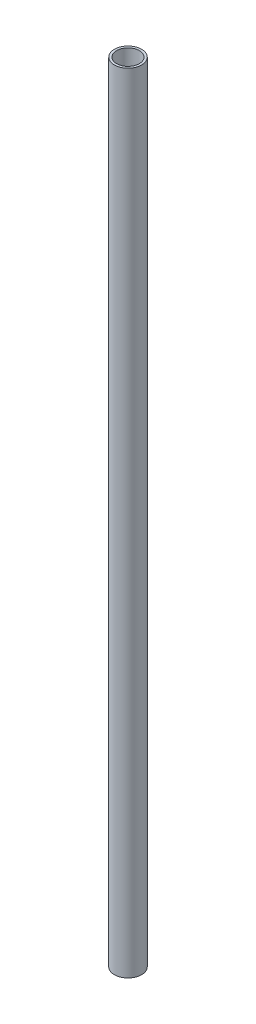
ISO-10303-21;
HEADER;
FILE_DESCRIPTION(('STEP AP214'),'2;1');
FILE_NAME('part.step','',(''),(''),'','','');
FILE_SCHEMA(('AUTOMOTIVE_DESIGN { 1 0 10303 214 1 1 1 1 }'));
ENDSEC;
DATA;
#1=APPLICATION_CONTEXT('core data for automotive mechanical design processes');
#2=APPLICATION_PROTOCOL_DEFINITION('international standard','automotive_design',2000,#1);
#3=PRODUCT_CONTEXT('',#1,'mechanical');
#4=PRODUCT('Part','Part','',(#3));
#5=PRODUCT_RELATED_PRODUCT_CATEGORY('part','',(#4));
#6=PRODUCT_DEFINITION_FORMATION('','',#4);
#7=PRODUCT_DEFINITION_CONTEXT('part definition',#1,'design');
#8=PRODUCT_DEFINITION('design','',#6,#7);
#9=PRODUCT_DEFINITION_SHAPE('','',#8);
#10=(LENGTH_UNIT() NAMED_UNIT(*) SI_UNIT(.MILLI.,.METRE.));
#11=(NAMED_UNIT(*) PLANE_ANGLE_UNIT() SI_UNIT($,.RADIAN.));
#12=(NAMED_UNIT(*) SI_UNIT($,.STERADIAN.) SOLID_ANGLE_UNIT());
#13=UNCERTAINTY_MEASURE_WITH_UNIT(LENGTH_MEASURE(1.E-05),#10,'distance_accuracy_value','');
#14=(GEOMETRIC_REPRESENTATION_CONTEXT(3) GLOBAL_UNCERTAINTY_ASSIGNED_CONTEXT((#13)) GLOBAL_UNIT_ASSIGNED_CONTEXT((#10,
#11,#12)) REPRESENTATION_CONTEXT('',''));
#15=CARTESIAN_POINT('',(0.,0.,0.));
#16=DIRECTION('',(0.,0.,1.));
#17=DIRECTION('',(1.,0.,0.));
#18=AXIS2_PLACEMENT_3D('',#15,#16,#17);
#19=CARTESIAN_POINT('',(0.,347.,0.));
#20=DIRECTION('',(0.,1.,0.));
#21=DIRECTION('',(0.,0.,1.));
#22=AXIS2_PLACEMENT_3D('',#19,#20,#21);
#23=PLANE('',#22);
#24=CARTESIAN_POINT('',(0.,347.,0.));
#25=DIRECTION('',(0.,1.,0.));
#26=DIRECTION('',(0.,0.,1.));
#27=AXIS2_PLACEMENT_3D('',#24,#25,#26);
#28=CIRCLE('',#27,6.);
#29=CARTESIAN_POINT('',(0.,347.,6.));
#30=VERTEX_POINT('',#29);
#31=EDGE_CURVE('E10',#30,#30,#28,.T.);
#32=ORIENTED_EDGE('',*,*,#31,.T.);
#33=EDGE_LOOP('',(#32));
#34=FACE_BOUND('',#33,.T.);
#35=CARTESIAN_POINT('',(0.,347.,0.));
#36=DIRECTION('',(0.,1.,0.));
#37=DIRECTION('',(0.,0.,1.));
#38=AXIS2_PLACEMENT_3D('',#35,#36,#37);
#39=CIRCLE('',#38,5.);
#40=CARTESIAN_POINT('',(0.,347.,5.));
#41=VERTEX_POINT('',#40);
#42=EDGE_CURVE('E42',#41,#41,#39,.T.);
#43=ORIENTED_EDGE('',*,*,#42,.F.);
#44=EDGE_LOOP('',(#43));
#45=FACE_BOUND('',#44,.T.);
#46=ADVANCED_FACE('F31',(#34,#45),#23,.T.);
#47=CARTESIAN_POINT('',(0.,0.,0.));
#48=DIRECTION('',(0.,1.,0.));
#49=DIRECTION('',(0.,0.,1.));
#50=AXIS2_PLACEMENT_3D('',#47,#48,#49);
#51=PLANE('',#50);
#52=CARTESIAN_POINT('',(0.,0.,0.));
#53=DIRECTION('',(0.,1.,0.));
#54=DIRECTION('',(0.,0.,1.));
#55=AXIS2_PLACEMENT_3D('',#52,#53,#54);
#56=CIRCLE('',#55,6.);
#57=CARTESIAN_POINT('',(0.,0.,6.));
#58=VERTEX_POINT('',#57);
#59=EDGE_CURVE('E35',#58,#58,#56,.T.);
#60=ORIENTED_EDGE('',*,*,#59,.F.);
#61=EDGE_LOOP('',(#60));
#62=FACE_BOUND('',#61,.T.);
#63=CARTESIAN_POINT('',(0.,0.,0.));
#64=DIRECTION('',(0.,1.,0.));
#65=DIRECTION('',(0.,0.,1.));
#66=AXIS2_PLACEMENT_3D('',#63,#64,#65);
#67=CIRCLE('',#66,5.);
#68=CARTESIAN_POINT('',(0.,0.,5.));
#69=VERTEX_POINT('',#68);
#70=EDGE_CURVE('E44',#69,#69,#67,.T.);
#71=ORIENTED_EDGE('',*,*,#70,.T.);
#72=EDGE_LOOP('',(#71));
#73=FACE_BOUND('',#72,.T.);
#74=ADVANCED_FACE('F54',(#62,#73),#51,.F.);
#75=CARTESIAN_POINT('',(0.,347.,0.));
#76=DIRECTION('',(0.,-1.,0.));
#77=DIRECTION('',(0.,0.,-1.));
#78=AXIS2_PLACEMENT_3D('',#75,#76,#77);
#79=CYLINDRICAL_SURFACE('',#78,6.);
#80=ORIENTED_EDGE('',*,*,#31,.F.);
#81=EDGE_LOOP('',(#80));
#82=FACE_BOUND('',#81,.T.);
#83=ORIENTED_EDGE('',*,*,#59,.T.);
#84=EDGE_LOOP('',(#83));
#85=FACE_BOUND('',#84,.T.);
#86=ADVANCED_FACE('F33',(#82,#85),#79,.T.);
#87=CARTESIAN_POINT('',(0.,347.,0.));
#88=DIRECTION('',(0.,-1.,0.));
#89=DIRECTION('',(0.,0.,-1.));
#90=AXIS2_PLACEMENT_3D('',#87,#88,#89);
#91=CYLINDRICAL_SURFACE('',#90,5.);
#92=ORIENTED_EDGE('',*,*,#42,.T.);
#93=EDGE_LOOP('',(#92));
#94=FACE_BOUND('',#93,.T.);
#95=ORIENTED_EDGE('',*,*,#70,.F.);
#96=EDGE_LOOP('',(#95));
#97=FACE_BOUND('',#96,.T.);
#98=ADVANCED_FACE('F50',(#94,#97),#91,.F.);
#99=CLOSED_SHELL('',(#46,#74,#86,#98));
#100=MANIFOLD_SOLID_BREP('B2',#99);
#101=ADVANCED_BREP_SHAPE_REPRESENTATION('',(#18,#100),#14);
#102=SHAPE_DEFINITION_REPRESENTATION(#9,#101);
ENDSEC;
END-ISO-10303-21;
